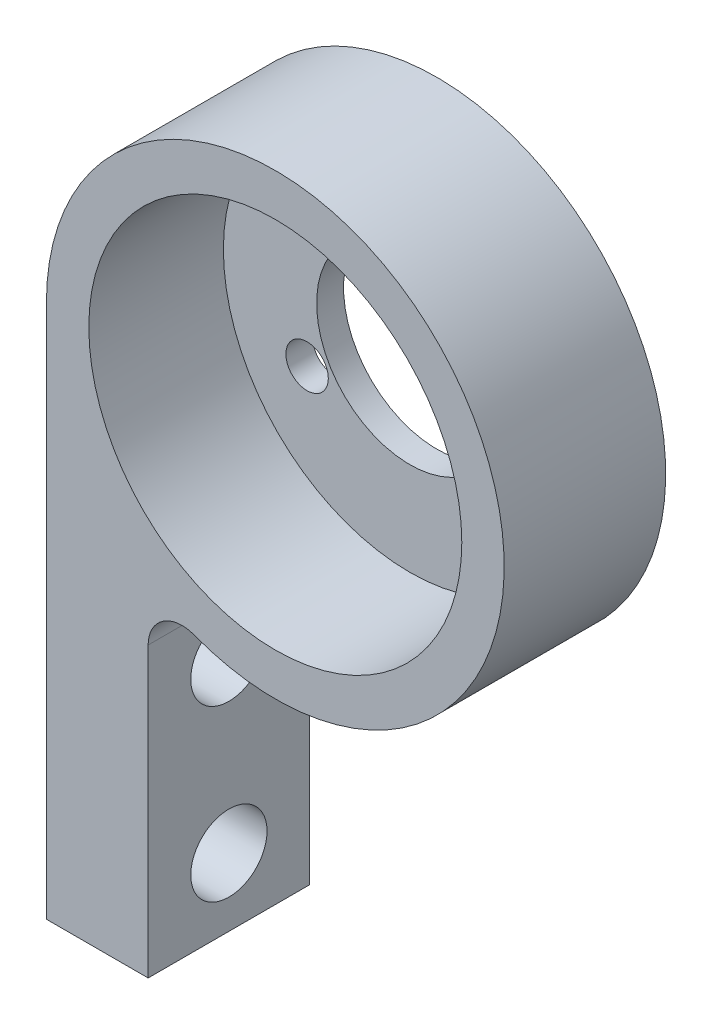
ISO-10303-21;
HEADER;
FILE_DESCRIPTION(('STEP AP214'),'2;1');
FILE_NAME('part.step','',(''),(''),'','','');
FILE_SCHEMA(('AUTOMOTIVE_DESIGN { 1 0 10303 214 1 1 1 1 }'));
ENDSEC;
DATA;
#1=APPLICATION_CONTEXT('core data for automotive mechanical design processes');
#2=APPLICATION_PROTOCOL_DEFINITION('international standard','automotive_design',2000,#1);
#3=PRODUCT_CONTEXT('',#1,'mechanical');
#4=PRODUCT('Part','Part','',(#3));
#5=PRODUCT_RELATED_PRODUCT_CATEGORY('part','',(#4));
#6=PRODUCT_DEFINITION_FORMATION('','',#4);
#7=PRODUCT_DEFINITION_CONTEXT('part definition',#1,'design');
#8=PRODUCT_DEFINITION('design','',#6,#7);
#9=PRODUCT_DEFINITION_SHAPE('','',#8);
#10=(LENGTH_UNIT() NAMED_UNIT(*) SI_UNIT(.MILLI.,.METRE.));
#11=(NAMED_UNIT(*) PLANE_ANGLE_UNIT() SI_UNIT($,.RADIAN.));
#12=(NAMED_UNIT(*) SI_UNIT($,.STERADIAN.) SOLID_ANGLE_UNIT());
#13=UNCERTAINTY_MEASURE_WITH_UNIT(LENGTH_MEASURE(1.E-05),#10,'distance_accuracy_value','');
#14=(GEOMETRIC_REPRESENTATION_CONTEXT(3) GLOBAL_UNCERTAINTY_ASSIGNED_CONTEXT((#13)) GLOBAL_UNIT_ASSIGNED_CONTEXT((#10,
#11,#12)) REPRESENTATION_CONTEXT('',''));
#15=CARTESIAN_POINT('',(0.,0.,0.));
#16=DIRECTION('',(0.,0.,1.));
#17=DIRECTION('',(1.,0.,0.));
#18=AXIS2_PLACEMENT_3D('',#15,#16,#17);
#19=CARTESIAN_POINT('',(0.,0.,-4.7625));
#20=DIRECTION('',(0.,0.,1.));
#21=DIRECTION('',(1.,0.,0.));
#22=AXIS2_PLACEMENT_3D('',#19,#20,#21);
#23=PLANE('',#22);
#24=CARTESIAN_POINT('',(10.5,22.75,-4.7625));
#25=DIRECTION('',(0.,0.,-1.));
#26=DIRECTION('',(-1.,0.,0.));
#27=AXIS2_PLACEMENT_3D('',#24,#25,#26);
#28=CIRCLE('',#27,1.24999999999999);
#29=CARTESIAN_POINT('',(9.25000000000001,22.75,-4.7625));
#30=VERTEX_POINT('',#29);
#31=EDGE_CURVE('E247',#30,#30,#28,.T.);
#32=ORIENTED_EDGE('',*,*,#31,.F.);
#33=EDGE_LOOP('',(#32));
#34=FACE_BOUND('',#33,.T.);
#35=CARTESIAN_POINT('',(16.562177826491,12.25,-4.7625));
#36=DIRECTION('',(0.,0.,-1.));
#37=DIRECTION('',(-1.,0.,0.));
#38=AXIS2_PLACEMENT_3D('',#35,#36,#37);
#39=CIRCLE('',#38,1.24999999999999);
#40=CARTESIAN_POINT('',(15.312177826491,12.25,-4.7625));
#41=VERTEX_POINT('',#40);
#42=EDGE_CURVE('E249',#41,#41,#39,.T.);
#43=ORIENTED_EDGE('',*,*,#42,.F.);
#44=EDGE_LOOP('',(#43));
#45=FACE_BOUND('',#44,.T.);
#46=CARTESIAN_POINT('',(10.5,15.75,-4.7625));
#47=DIRECTION('',(0.,0.,1.));
#48=DIRECTION('',(1.,0.,0.));
#49=AXIS2_PLACEMENT_3D('',#46,#47,#48);
#50=CIRCLE('',#49,13.5);
#51=CARTESIAN_POINT('',(5.70967741935484,3.128478317835,-4.7625));
#52=VERTEX_POINT('',#51);
#53=CARTESIAN_POINT('',(-3.,15.75,-4.7625));
#54=VERTEX_POINT('',#53);
#55=EDGE_CURVE('E120',#52,#54,#50,.T.);
#56=ORIENTED_EDGE('',*,*,#55,.F.);
#57=CARTESIAN_POINT('',(5.,1.25862325381056,-4.7625));
#58=DIRECTION('',(0.,0.,1.));
#59=DIRECTION('',(1.,0.,0.));
#60=AXIS2_PLACEMENT_3D('',#57,#58,#59);
#61=CIRCLE('',#60,2.);
#62=CARTESIAN_POINT('',(3.,1.25862325381056,-4.7625));
#63=VERTEX_POINT('',#62);
#64=EDGE_CURVE('E64',#52,#63,#61,.T.);
#65=ORIENTED_EDGE('',*,*,#64,.T.);
#66=DIRECTION('',(0.,1.,0.));
#67=VECTOR('',#66,1.);
#68=CARTESIAN_POINT('',(3.,0.,-4.7625));
#69=LINE('',#68,#67);
#70=CARTESIAN_POINT('',(3.,-15.75,-4.7625));
#71=VERTEX_POINT('',#70);
#72=EDGE_CURVE('E143',#71,#63,#69,.T.);
#73=ORIENTED_EDGE('',*,*,#72,.F.);
#74=DIRECTION('',(-1.,0.,0.));
#75=VECTOR('',#74,1.);
#76=CARTESIAN_POINT('',(0.,-15.75,-4.7625));
#77=LINE('',#76,#75);
#78=CARTESIAN_POINT('',(-3.,-15.75,-4.7625));
#79=VERTEX_POINT('',#78);
#80=EDGE_CURVE('E140',#71,#79,#77,.T.);
#81=ORIENTED_EDGE('',*,*,#80,.T.);
#82=DIRECTION('',(0.,1.,0.));
#83=VECTOR('',#82,1.);
#84=CARTESIAN_POINT('',(-3.,0.,-4.7625));
#85=LINE('',#84,#83);
#86=EDGE_CURVE('E137',#79,#54,#85,.T.);
#87=ORIENTED_EDGE('',*,*,#86,.T.);
#88=EDGE_LOOP('',(#56,#65,#73,#81,#87));
#89=FACE_BOUND('',#88,.T.);
#90=CARTESIAN_POINT('',(10.5,15.75,-4.7625));
#91=DIRECTION('',(0.,0.,1.));
#92=DIRECTION('',(1.,0.,0.));
#93=AXIS2_PLACEMENT_3D('',#90,#91,#92);
#94=CIRCLE('',#93,5.5);
#95=CARTESIAN_POINT('',(16.,15.75,-4.7625));
#96=VERTEX_POINT('',#95);
#97=EDGE_CURVE('E115',#96,#96,#94,.T.);
#98=ORIENTED_EDGE('',*,*,#97,.T.);
#99=EDGE_LOOP('',(#98));
#100=FACE_BOUND('',#99,.T.);
#101=CARTESIAN_POINT('',(4.437822173509,12.25,-4.7625));
#102=DIRECTION('',(0.,0.,-1.));
#103=DIRECTION('',(-1.,0.,0.));
#104=AXIS2_PLACEMENT_3D('',#101,#102,#103);
#105=CIRCLE('',#104,1.24999999999999);
#106=CARTESIAN_POINT('',(3.18782217350901,12.25,-4.7625));
#107=VERTEX_POINT('',#106);
#108=EDGE_CURVE('E253',#107,#107,#105,.T.);
#109=ORIENTED_EDGE('',*,*,#108,.F.);
#110=EDGE_LOOP('',(#109));
#111=FACE_BOUND('',#110,.T.);
#112=ADVANCED_FACE('F55',(#34,#45,#89,#100,#111),#23,.F.);
#113=CARTESIAN_POINT('',(10.5,15.75,4.7625));
#114=DIRECTION('',(0.,0.,-1.));
#115=DIRECTION('',(-1.,0.,0.));
#116=AXIS2_PLACEMENT_3D('',#113,#114,#115);
#117=CYLINDRICAL_SURFACE('',#116,5.5);
#118=ORIENTED_EDGE('',*,*,#97,.F.);
#119=EDGE_LOOP('',(#118));
#120=FACE_BOUND('',#119,.T.);
#121=CARTESIAN_POINT('',(10.5,15.75,-3.175));
#122=DIRECTION('',(0.,0.,1.));
#123=DIRECTION('',(1.,0.,0.));
#124=AXIS2_PLACEMENT_3D('',#121,#122,#123);
#125=CIRCLE('',#124,5.5);
#126=CARTESIAN_POINT('',(16.,15.75,-3.175));
#127=VERTEX_POINT('',#126);
#128=EDGE_CURVE('E151',#127,#127,#125,.T.);
#129=ORIENTED_EDGE('',*,*,#128,.T.);
#130=EDGE_LOOP('',(#129));
#131=FACE_BOUND('',#130,.T.);
#132=ADVANCED_FACE('F203',(#120,#131),#117,.F.);
#133=CARTESIAN_POINT('',(10.5,15.75,4.7625));
#134=DIRECTION('',(0.,0.,-1.));
#135=DIRECTION('',(-1.,0.,0.));
#136=AXIS2_PLACEMENT_3D('',#133,#134,#135);
#137=CYLINDRICAL_SURFACE('',#136,13.5);
#138=CARTESIAN_POINT('',(10.5,15.75,4.7625));
#139=DIRECTION('',(0.,0.,1.));
#140=DIRECTION('',(1.,0.,0.));
#141=AXIS2_PLACEMENT_3D('',#138,#139,#140);
#142=CIRCLE('',#141,13.5);
#143=CARTESIAN_POINT('',(5.70967741935484,3.128478317835,4.7625));
#144=VERTEX_POINT('',#143);
#145=CARTESIAN_POINT('',(-3.,15.75,4.7625));
#146=VERTEX_POINT('',#145);
#147=EDGE_CURVE('E104',#144,#146,#142,.T.);
#148=ORIENTED_EDGE('',*,*,#147,.F.);
#149=DIRECTION('',(0.,0.,-1.));
#150=VECTOR('',#149,1.);
#151=CARTESIAN_POINT('',(5.70967741935484,3.128478317835,4.7625));
#152=LINE('',#151,#150);
#153=EDGE_CURVE('E124',#144,#52,#152,.T.);
#154=ORIENTED_EDGE('',*,*,#153,.T.);
#155=ORIENTED_EDGE('',*,*,#55,.T.);
#156=DIRECTION('',(0.,0.,-1.));
#157=VECTOR('',#156,1.);
#158=CARTESIAN_POINT('',(-3.,15.75,4.7625));
#159=LINE('',#158,#157);
#160=EDGE_CURVE('E118',#146,#54,#159,.T.);
#161=ORIENTED_EDGE('',*,*,#160,.F.);
#162=EDGE_LOOP('',(#148,#154,#155,#161));
#163=FACE_BOUND('',#162,.T.);
#164=ADVANCED_FACE('F119',(#163),#137,.T.);
#165=CARTESIAN_POINT('',(-3.,0.,4.7625));
#166=DIRECTION('',(-1.,0.,0.));
#167=DIRECTION('',(0.,0.,1.));
#168=AXIS2_PLACEMENT_3D('',#165,#166,#167);
#169=PLANE('',#168);
#170=CARTESIAN_POINT('',(-3.,-1.75000000000001,0.));
#171=DIRECTION('',(1.,0.,0.));
#172=DIRECTION('',(0.,0.,-1.));
#173=AXIS2_PLACEMENT_3D('',#170,#171,#172);
#174=CIRCLE('',#173,2.25);
#175=CARTESIAN_POINT('',(-3.,-1.75000000000001,-2.25));
#176=VERTEX_POINT('',#175);
#177=EDGE_CURVE('E158',#176,#176,#174,.T.);
#178=ORIENTED_EDGE('',*,*,#177,.T.);
#179=EDGE_LOOP('',(#178));
#180=FACE_BOUND('',#179,.T.);
#181=CARTESIAN_POINT('',(-3.,-11.75,0.));
#182=DIRECTION('',(1.,0.,0.));
#183=DIRECTION('',(0.,0.,-1.));
#184=AXIS2_PLACEMENT_3D('',#181,#182,#183);
#185=CIRCLE('',#184,2.25);
#186=CARTESIAN_POINT('',(-3.,-11.75,-2.25));
#187=VERTEX_POINT('',#186);
#188=EDGE_CURVE('E138',#187,#187,#185,.T.);
#189=ORIENTED_EDGE('',*,*,#188,.T.);
#190=EDGE_LOOP('',(#189));
#191=FACE_BOUND('',#190,.T.);
#192=ORIENTED_EDGE('',*,*,#86,.F.);
#193=DIRECTION('',(0.,0.,-1.));
#194=VECTOR('',#193,1.);
#195=CARTESIAN_POINT('',(-3.,-15.75,4.7625));
#196=LINE('',#195,#194);
#197=CARTESIAN_POINT('',(-3.,-15.75,4.7625));
#198=VERTEX_POINT('',#197);
#199=EDGE_CURVE('E125',#198,#79,#196,.T.);
#200=ORIENTED_EDGE('',*,*,#199,.F.);
#201=DIRECTION('',(0.,1.,0.));
#202=VECTOR('',#201,1.);
#203=CARTESIAN_POINT('',(-3.,0.,4.7625));
#204=LINE('',#203,#202);
#205=EDGE_CURVE('E109',#198,#146,#204,.T.);
#206=ORIENTED_EDGE('',*,*,#205,.T.);
#207=ORIENTED_EDGE('',*,*,#160,.T.);
#208=EDGE_LOOP('',(#192,#200,#206,#207));
#209=FACE_BOUND('',#208,.T.);
#210=ADVANCED_FACE('F127',(#180,#191,#209),#169,.T.);
#211=CARTESIAN_POINT('',(0.,-15.75,4.7625));
#212=DIRECTION('',(0.,-1.,0.));
#213=DIRECTION('',(0.,0.,-1.));
#214=AXIS2_PLACEMENT_3D('',#211,#212,#213);
#215=PLANE('',#214);
#216=ORIENTED_EDGE('',*,*,#80,.F.);
#217=DIRECTION('',(0.,0.,-1.));
#218=VECTOR('',#217,1.);
#219=CARTESIAN_POINT('',(3.,-15.75,4.7625));
#220=LINE('',#219,#218);
#221=CARTESIAN_POINT('',(3.,-15.75,4.7625));
#222=VERTEX_POINT('',#221);
#223=EDGE_CURVE('E135',#222,#71,#220,.T.);
#224=ORIENTED_EDGE('',*,*,#223,.F.);
#225=DIRECTION('',(-1.,0.,0.));
#226=VECTOR('',#225,1.);
#227=CARTESIAN_POINT('',(0.,-15.75,4.7625));
#228=LINE('',#227,#226);
#229=EDGE_CURVE('E128',#222,#198,#228,.T.);
#230=ORIENTED_EDGE('',*,*,#229,.T.);
#231=ORIENTED_EDGE('',*,*,#199,.T.);
#232=EDGE_LOOP('',(#216,#224,#230,#231));
#233=FACE_BOUND('',#232,.T.);
#234=ADVANCED_FACE('F188',(#233),#215,.T.);
#235=CARTESIAN_POINT('',(3.,0.,4.7625));
#236=DIRECTION('',(-1.,0.,0.));
#237=DIRECTION('',(0.,0.,1.));
#238=AXIS2_PLACEMENT_3D('',#235,#236,#237);
#239=PLANE('',#238);
#240=CARTESIAN_POINT('',(3.,-1.75000000000001,0.));
#241=DIRECTION('',(1.,0.,0.));
#242=DIRECTION('',(0.,0.,-1.));
#243=AXIS2_PLACEMENT_3D('',#240,#241,#242);
#244=CIRCLE('',#243,2.25);
#245=CARTESIAN_POINT('',(3.,-1.75000000000001,-2.25));
#246=VERTEX_POINT('',#245);
#247=EDGE_CURVE('E153',#246,#246,#244,.T.);
#248=ORIENTED_EDGE('',*,*,#247,.F.);
#249=EDGE_LOOP('',(#248));
#250=FACE_BOUND('',#249,.T.);
#251=CARTESIAN_POINT('',(3.,-11.75,0.));
#252=DIRECTION('',(1.,0.,0.));
#253=DIRECTION('',(0.,0.,-1.));
#254=AXIS2_PLACEMENT_3D('',#251,#252,#253);
#255=CIRCLE('',#254,2.25);
#256=CARTESIAN_POINT('',(3.,-11.75,-2.25));
#257=VERTEX_POINT('',#256);
#258=EDGE_CURVE('E173',#257,#257,#255,.T.);
#259=ORIENTED_EDGE('',*,*,#258,.F.);
#260=EDGE_LOOP('',(#259));
#261=FACE_BOUND('',#260,.T.);
#262=ORIENTED_EDGE('',*,*,#72,.T.);
#263=DIRECTION('',(0.,0.,1.));
#264=VECTOR('',#263,1.);
#265=CARTESIAN_POINT('',(3.,1.25862325381056,4.7625));
#266=LINE('',#265,#264);
#267=CARTESIAN_POINT('',(3.,1.25862325381056,4.7625));
#268=VERTEX_POINT('',#267);
#269=EDGE_CURVE('E72',#63,#268,#266,.T.);
#270=ORIENTED_EDGE('',*,*,#269,.T.);
#271=DIRECTION('',(0.,1.,0.));
#272=VECTOR('',#271,1.);
#273=CARTESIAN_POINT('',(3.,0.,4.7625));
#274=LINE('',#273,#272);
#275=EDGE_CURVE('E130',#222,#268,#274,.T.);
#276=ORIENTED_EDGE('',*,*,#275,.F.);
#277=ORIENTED_EDGE('',*,*,#223,.T.);
#278=EDGE_LOOP('',(#262,#270,#276,#277));
#279=FACE_BOUND('',#278,.T.);
#280=ADVANCED_FACE('F186',(#250,#261,#279),#239,.F.);
#281=CARTESIAN_POINT('',(0.,0.,4.7625));
#282=DIRECTION('',(0.,0.,1.));
#283=DIRECTION('',(1.,0.,0.));
#284=AXIS2_PLACEMENT_3D('',#281,#282,#283);
#285=PLANE('',#284);
#286=CARTESIAN_POINT('',(10.5,15.75,4.7625));
#287=DIRECTION('',(0.,0.,1.));
#288=DIRECTION('',(1.,0.,0.));
#289=AXIS2_PLACEMENT_3D('',#286,#287,#288);
#290=CIRCLE('',#289,11.);
#291=CARTESIAN_POINT('',(21.5,15.75,4.7625));
#292=VERTEX_POINT('',#291);
#293=EDGE_CURVE('E161',#292,#292,#290,.T.);
#294=ORIENTED_EDGE('',*,*,#293,.F.);
#295=EDGE_LOOP('',(#294));
#296=FACE_BOUND('',#295,.T.);
#297=ORIENTED_EDGE('',*,*,#275,.T.);
#298=CARTESIAN_POINT('',(5.,1.25862325381056,4.7625));
#299=DIRECTION('',(0.,0.,1.));
#300=DIRECTION('',(1.,0.,0.));
#301=AXIS2_PLACEMENT_3D('',#298,#299,#300);
#302=CIRCLE('',#301,2.);
#303=EDGE_CURVE('E11',#268,#144,#302,.F.);
#304=ORIENTED_EDGE('',*,*,#303,.T.);
#305=ORIENTED_EDGE('',*,*,#147,.T.);
#306=ORIENTED_EDGE('',*,*,#205,.F.);
#307=ORIENTED_EDGE('',*,*,#229,.F.);
#308=EDGE_LOOP('',(#297,#304,#305,#306,#307));
#309=FACE_BOUND('',#308,.T.);
#310=ADVANCED_FACE('F106',(#296,#309),#285,.T.);
#311=CARTESIAN_POINT('',(3.,-11.75,0.));
#312=DIRECTION('',(1.,0.,0.));
#313=DIRECTION('',(0.,0.,-1.));
#314=AXIS2_PLACEMENT_3D('',#311,#312,#313);
#315=CYLINDRICAL_SURFACE('',#314,2.25);
#316=ORIENTED_EDGE('',*,*,#188,.F.);
#317=EDGE_LOOP('',(#316));
#318=FACE_BOUND('',#317,.T.);
#319=ORIENTED_EDGE('',*,*,#258,.T.);
#320=EDGE_LOOP('',(#319));
#321=FACE_BOUND('',#320,.T.);
#322=ADVANCED_FACE('F179',(#318,#321),#315,.F.);
#323=CARTESIAN_POINT('',(3.,-1.75000000000001,0.));
#324=DIRECTION('',(1.,0.,0.));
#325=DIRECTION('',(0.,0.,-1.));
#326=AXIS2_PLACEMENT_3D('',#323,#324,#325);
#327=CYLINDRICAL_SURFACE('',#326,2.25);
#328=ORIENTED_EDGE('',*,*,#177,.F.);
#329=EDGE_LOOP('',(#328));
#330=FACE_BOUND('',#329,.T.);
#331=ORIENTED_EDGE('',*,*,#247,.T.);
#332=EDGE_LOOP('',(#331));
#333=FACE_BOUND('',#332,.T.);
#334=ADVANCED_FACE('F182',(#330,#333),#327,.F.);
#335=CARTESIAN_POINT('',(5.,1.25862325381056,4.7625));
#336=DIRECTION('',(0.,0.,-1.));
#337=DIRECTION('',(-1.,0.,0.));
#338=AXIS2_PLACEMENT_3D('',#335,#336,#337);
#339=CYLINDRICAL_SURFACE('',#338,2.);
#340=ORIENTED_EDGE('',*,*,#303,.F.);
#341=ORIENTED_EDGE('',*,*,#269,.F.);
#342=ORIENTED_EDGE('',*,*,#64,.F.);
#343=ORIENTED_EDGE('',*,*,#153,.F.);
#344=EDGE_LOOP('',(#340,#341,#342,#343));
#345=FACE_BOUND('',#344,.T.);
#346=ADVANCED_FACE('F57',(#345),#339,.F.);
#347=CARTESIAN_POINT('',(10.5,15.75,-3.175));
#348=DIRECTION('',(0.,0.,1.));
#349=DIRECTION('',(1.,0.,0.));
#350=AXIS2_PLACEMENT_3D('',#347,#348,#349);
#351=CYLINDRICAL_SURFACE('',#350,11.);
#352=CARTESIAN_POINT('',(10.5,15.75,-3.175));
#353=DIRECTION('',(0.,0.,1.));
#354=DIRECTION('',(1.,0.,0.));
#355=AXIS2_PLACEMENT_3D('',#352,#353,#354);
#356=CIRCLE('',#355,11.);
#357=CARTESIAN_POINT('',(21.5,15.75,-3.175));
#358=VERTEX_POINT('',#357);
#359=EDGE_CURVE('E154',#358,#358,#356,.T.);
#360=ORIENTED_EDGE('',*,*,#359,.F.);
#361=EDGE_LOOP('',(#360));
#362=FACE_BOUND('',#361,.T.);
#363=ORIENTED_EDGE('',*,*,#293,.T.);
#364=EDGE_LOOP('',(#363));
#365=FACE_BOUND('',#364,.T.);
#366=ADVANCED_FACE('F221',(#362,#365),#351,.F.);
#367=CARTESIAN_POINT('',(10.5,15.75,-3.175));
#368=DIRECTION('',(0.,0.,1.));
#369=DIRECTION('',(1.,0.,0.));
#370=AXIS2_PLACEMENT_3D('',#367,#368,#369);
#371=PLANE('',#370);
#372=CARTESIAN_POINT('',(10.5,22.75,-3.175));
#373=DIRECTION('',(0.,0.,1.));
#374=DIRECTION('',(1.,0.,0.));
#375=AXIS2_PLACEMENT_3D('',#372,#373,#374);
#376=CIRCLE('',#375,1.24999999999999);
#377=CARTESIAN_POINT('',(11.75,22.75,-3.175));
#378=VERTEX_POINT('',#377);
#379=EDGE_CURVE('E245',#378,#378,#376,.T.);
#380=ORIENTED_EDGE('',*,*,#379,.F.);
#381=EDGE_LOOP('',(#380));
#382=FACE_BOUND('',#381,.T.);
#383=CARTESIAN_POINT('',(16.562177826491,12.25,-3.175));
#384=DIRECTION('',(0.,0.,1.));
#385=DIRECTION('',(1.,0.,0.));
#386=AXIS2_PLACEMENT_3D('',#383,#384,#385);
#387=CIRCLE('',#386,1.24999999999999);
#388=CARTESIAN_POINT('',(17.812177826491,12.25,-3.175));
#389=VERTEX_POINT('',#388);
#390=EDGE_CURVE('E59',#389,#389,#387,.T.);
#391=ORIENTED_EDGE('',*,*,#390,.F.);
#392=EDGE_LOOP('',(#391));
#393=FACE_BOUND('',#392,.T.);
#394=CARTESIAN_POINT('',(4.437822173509,12.25,-3.175));
#395=DIRECTION('',(0.,0.,1.));
#396=DIRECTION('',(1.,0.,0.));
#397=AXIS2_PLACEMENT_3D('',#394,#395,#396);
#398=CIRCLE('',#397,1.24999999999999);
#399=CARTESIAN_POINT('',(5.68782217350899,12.25,-3.175));
#400=VERTEX_POINT('',#399);
#401=EDGE_CURVE('E166',#400,#400,#398,.T.);
#402=ORIENTED_EDGE('',*,*,#401,.F.);
#403=EDGE_LOOP('',(#402));
#404=FACE_BOUND('',#403,.T.);
#405=ORIENTED_EDGE('',*,*,#128,.F.);
#406=EDGE_LOOP('',(#405));
#407=FACE_BOUND('',#406,.T.);
#408=ORIENTED_EDGE('',*,*,#359,.T.);
#409=EDGE_LOOP('',(#408));
#410=FACE_BOUND('',#409,.T.);
#411=ADVANCED_FACE('F224',(#382,#393,#404,#407,#410),#371,.T.);
#412=CARTESIAN_POINT('',(4.437822173509,12.25,-4.7625));
#413=DIRECTION('',(0.,0.,-1.));
#414=DIRECTION('',(-1.,0.,0.));
#415=AXIS2_PLACEMENT_3D('',#412,#413,#414);
#416=CYLINDRICAL_SURFACE('',#415,1.24999999999999);
#417=ORIENTED_EDGE('',*,*,#401,.T.);
#418=EDGE_LOOP('',(#417));
#419=FACE_BOUND('',#418,.T.);
#420=ORIENTED_EDGE('',*,*,#108,.T.);
#421=EDGE_LOOP('',(#420));
#422=FACE_BOUND('',#421,.T.);
#423=ADVANCED_FACE('F228',(#419,#422),#416,.F.);
#424=CARTESIAN_POINT('',(16.562177826491,12.25,-4.7625));
#425=DIRECTION('',(0.,0.,-1.));
#426=DIRECTION('',(-1.,0.,0.));
#427=AXIS2_PLACEMENT_3D('',#424,#425,#426);
#428=CYLINDRICAL_SURFACE('',#427,1.24999999999999);
#429=ORIENTED_EDGE('',*,*,#390,.T.);
#430=EDGE_LOOP('',(#429));
#431=FACE_BOUND('',#430,.T.);
#432=ORIENTED_EDGE('',*,*,#42,.T.);
#433=EDGE_LOOP('',(#432));
#434=FACE_BOUND('',#433,.T.);
#435=ADVANCED_FACE('F232',(#431,#434),#428,.F.);
#436=CARTESIAN_POINT('',(10.5,22.75,-4.7625));
#437=DIRECTION('',(0.,0.,-1.));
#438=DIRECTION('',(-1.,0.,0.));
#439=AXIS2_PLACEMENT_3D('',#436,#437,#438);
#440=CYLINDRICAL_SURFACE('',#439,1.24999999999999);
#441=ORIENTED_EDGE('',*,*,#379,.T.);
#442=EDGE_LOOP('',(#441));
#443=FACE_BOUND('',#442,.T.);
#444=ORIENTED_EDGE('',*,*,#31,.T.);
#445=EDGE_LOOP('',(#444));
#446=FACE_BOUND('',#445,.T.);
#447=ADVANCED_FACE('F236',(#443,#446),#440,.F.);
#448=CLOSED_SHELL('',(#112,#132,#164,#210,#234,#280,#310,#322,#334,#346,#366,#411,#423,#435,#447));
#449=MANIFOLD_SOLID_BREP('B2',#448);
#450=ADVANCED_BREP_SHAPE_REPRESENTATION('',(#18,#449),#14);
#451=SHAPE_DEFINITION_REPRESENTATION(#9,#450);
ENDSEC;
END-ISO-10303-21;
